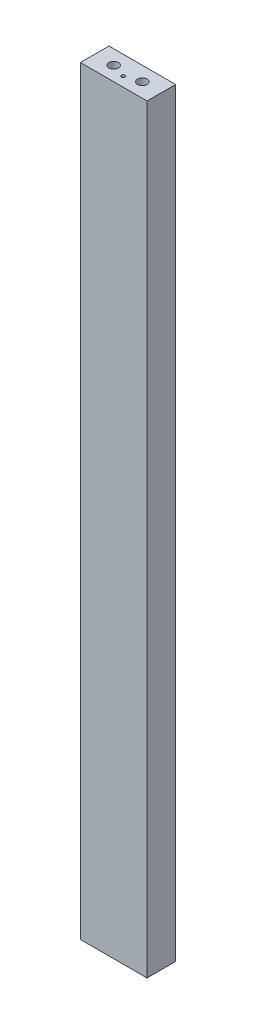
ISO-10303-21;
HEADER;
FILE_DESCRIPTION(('STEP AP214'),'2;1');
FILE_NAME('part.step','',(''),(''),'','','');
FILE_SCHEMA(('AUTOMOTIVE_DESIGN { 1 0 10303 214 1 1 1 1 }'));
ENDSEC;
DATA;
#1=APPLICATION_CONTEXT('core data for automotive mechanical design processes');
#2=APPLICATION_PROTOCOL_DEFINITION('international standard','automotive_design',2000,#1);
#3=PRODUCT_CONTEXT('',#1,'mechanical');
#4=PRODUCT('Part','Part','',(#3));
#5=PRODUCT_RELATED_PRODUCT_CATEGORY('part','',(#4));
#6=PRODUCT_DEFINITION_FORMATION('','',#4);
#7=PRODUCT_DEFINITION_CONTEXT('part definition',#1,'design');
#8=PRODUCT_DEFINITION('design','',#6,#7);
#9=PRODUCT_DEFINITION_SHAPE('','',#8);
#10=(LENGTH_UNIT() NAMED_UNIT(*) SI_UNIT(.MILLI.,.METRE.));
#11=(NAMED_UNIT(*) PLANE_ANGLE_UNIT() SI_UNIT($,.RADIAN.));
#12=(NAMED_UNIT(*) SI_UNIT($,.STERADIAN.) SOLID_ANGLE_UNIT());
#13=UNCERTAINTY_MEASURE_WITH_UNIT(LENGTH_MEASURE(1.E-05),#10,'distance_accuracy_value','');
#14=(GEOMETRIC_REPRESENTATION_CONTEXT(3) GLOBAL_UNCERTAINTY_ASSIGNED_CONTEXT((#13)) GLOBAL_UNIT_ASSIGNED_CONTEXT((#10,
#11,#12)) REPRESENTATION_CONTEXT('',''));
#15=CARTESIAN_POINT('',(0.,0.,0.));
#16=DIRECTION('',(0.,0.,1.));
#17=DIRECTION('',(1.,0.,0.));
#18=AXIS2_PLACEMENT_3D('',#15,#16,#17);
#19=CARTESIAN_POINT('',(0.,1012.825,0.));
#20=DIRECTION('',(1.,0.,0.));
#21=DIRECTION('',(0.,0.,-1.));
#22=AXIS2_PLACEMENT_3D('',#19,#20,#21);
#23=PLANE('',#22);
#24=DIRECTION('',(0.,0.,1.));
#25=VECTOR('',#24,1.);
#26=CARTESIAN_POINT('',(0.,0.,0.));
#27=LINE('',#26,#25);
#28=CARTESIAN_POINT('',(0.,0.,0.));
#29=VERTEX_POINT('',#28);
#30=CARTESIAN_POINT('',(0.,0.,38.1));
#31=VERTEX_POINT('',#30);
#32=EDGE_CURVE('E149',#29,#31,#27,.T.);
#33=ORIENTED_EDGE('',*,*,#32,.T.);
#34=DIRECTION('',(0.,-1.,0.));
#35=VECTOR('',#34,1.);
#36=CARTESIAN_POINT('',(0.,1012.825,38.1));
#37=LINE('',#36,#35);
#38=CARTESIAN_POINT('',(0.,1012.825,38.1));
#39=VERTEX_POINT('',#38);
#40=EDGE_CURVE('E12',#39,#31,#37,.T.);
#41=ORIENTED_EDGE('',*,*,#40,.F.);
#42=DIRECTION('',(0.,0.,1.));
#43=VECTOR('',#42,1.);
#44=CARTESIAN_POINT('',(0.,1012.825,0.));
#45=LINE('',#44,#43);
#46=CARTESIAN_POINT('',(0.,1012.825,0.));
#47=VERTEX_POINT('',#46);
#48=EDGE_CURVE('E158',#47,#39,#45,.T.);
#49=ORIENTED_EDGE('',*,*,#48,.F.);
#50=DIRECTION('',(0.,-1.,0.));
#51=VECTOR('',#50,1.);
#52=CARTESIAN_POINT('',(0.,1012.825,0.));
#53=LINE('',#52,#51);
#54=EDGE_CURVE('E164',#47,#29,#53,.T.);
#55=ORIENTED_EDGE('',*,*,#54,.T.);
#56=EDGE_LOOP('',(#33,#41,#49,#55));
#57=FACE_BOUND('',#56,.T.);
#58=ADVANCED_FACE('F49',(#57),#23,.F.);
#59=CARTESIAN_POINT('',(0.,1012.825,38.1));
#60=DIRECTION('',(0.,0.,-1.));
#61=DIRECTION('',(-1.,0.,0.));
#62=AXIS2_PLACEMENT_3D('',#59,#60,#61);
#63=PLANE('',#62);
#64=DIRECTION('',(1.,0.,0.));
#65=VECTOR('',#64,1.);
#66=CARTESIAN_POINT('',(0.,0.,38.1));
#67=LINE('',#66,#65);
#68=CARTESIAN_POINT('',(88.9,0.,38.1));
#69=VERTEX_POINT('',#68);
#70=EDGE_CURVE('E167',#31,#69,#67,.T.);
#71=ORIENTED_EDGE('',*,*,#70,.T.);
#72=DIRECTION('',(0.,-1.,0.));
#73=VECTOR('',#72,1.);
#74=CARTESIAN_POINT('',(88.9,1012.825,38.1));
#75=LINE('',#74,#73);
#76=CARTESIAN_POINT('',(88.9,1012.825,38.1));
#77=VERTEX_POINT('',#76);
#78=EDGE_CURVE('E57',#77,#69,#75,.T.);
#79=ORIENTED_EDGE('',*,*,#78,.F.);
#80=DIRECTION('',(1.,0.,0.));
#81=VECTOR('',#80,1.);
#82=CARTESIAN_POINT('',(0.,1012.825,38.1));
#83=LINE('',#82,#81);
#84=EDGE_CURVE('E96',#39,#77,#83,.T.);
#85=ORIENTED_EDGE('',*,*,#84,.F.);
#86=ORIENTED_EDGE('',*,*,#40,.T.);
#87=EDGE_LOOP('',(#71,#79,#85,#86));
#88=FACE_BOUND('',#87,.T.);
#89=ADVANCED_FACE('F192',(#88),#63,.F.);
#90=CARTESIAN_POINT('',(88.9,1012.825,0.));
#91=DIRECTION('',(-1.,0.,0.));
#92=DIRECTION('',(0.,0.,1.));
#93=AXIS2_PLACEMENT_3D('',#90,#91,#92);
#94=PLANE('',#93);
#95=DIRECTION('',(0.,0.,-1.));
#96=VECTOR('',#95,1.);
#97=CARTESIAN_POINT('',(88.9,0.,0.));
#98=LINE('',#97,#96);
#99=CARTESIAN_POINT('',(88.9,0.,0.));
#100=VERTEX_POINT('',#99);
#101=EDGE_CURVE('E83',#69,#100,#98,.T.);
#102=ORIENTED_EDGE('',*,*,#101,.T.);
#103=DIRECTION('',(0.,-1.,0.));
#104=VECTOR('',#103,1.);
#105=CARTESIAN_POINT('',(88.9,1012.825,0.));
#106=LINE('',#105,#104);
#107=CARTESIAN_POINT('',(88.9,1012.825,0.));
#108=VERTEX_POINT('',#107);
#109=EDGE_CURVE('E172',#108,#100,#106,.T.);
#110=ORIENTED_EDGE('',*,*,#109,.F.);
#111=DIRECTION('',(0.,0.,-1.));
#112=VECTOR('',#111,1.);
#113=CARTESIAN_POINT('',(88.9,1012.825,0.));
#114=LINE('',#113,#112);
#115=EDGE_CURVE('E161',#77,#108,#114,.T.);
#116=ORIENTED_EDGE('',*,*,#115,.F.);
#117=ORIENTED_EDGE('',*,*,#78,.T.);
#118=EDGE_LOOP('',(#102,#110,#116,#117));
#119=FACE_BOUND('',#118,.T.);
#120=ADVANCED_FACE('F174',(#119),#94,.F.);
#121=CARTESIAN_POINT('',(0.,1012.825,0.));
#122=DIRECTION('',(0.,0.,1.));
#123=DIRECTION('',(1.,0.,0.));
#124=AXIS2_PLACEMENT_3D('',#121,#122,#123);
#125=PLANE('',#124);
#126=DIRECTION('',(-1.,0.,0.));
#127=VECTOR('',#126,1.);
#128=CARTESIAN_POINT('',(0.,0.,0.));
#129=LINE('',#128,#127);
#130=EDGE_CURVE('E89',#100,#29,#129,.T.);
#131=ORIENTED_EDGE('',*,*,#130,.T.);
#132=ORIENTED_EDGE('',*,*,#54,.F.);
#133=DIRECTION('',(-1.,0.,0.));
#134=VECTOR('',#133,1.);
#135=CARTESIAN_POINT('',(0.,1012.825,0.));
#136=LINE('',#135,#134);
#137=EDGE_CURVE('E65',#108,#47,#136,.T.);
#138=ORIENTED_EDGE('',*,*,#137,.F.);
#139=ORIENTED_EDGE('',*,*,#109,.T.);
#140=EDGE_LOOP('',(#131,#132,#138,#139));
#141=FACE_BOUND('',#140,.T.);
#142=ADVANCED_FACE('F181',(#141),#125,.F.);
#143=CARTESIAN_POINT('',(0.,1012.825,0.));
#144=DIRECTION('',(0.,1.,0.));
#145=DIRECTION('',(0.,0.,1.));
#146=AXIS2_PLACEMENT_3D('',#143,#144,#145);
#147=PLANE('',#146);
#148=CARTESIAN_POINT('',(44.45,1012.825,25.4));
#149=DIRECTION('',(0.,1.,0.));
#150=DIRECTION('',(0.,0.,1.));
#151=AXIS2_PLACEMENT_3D('',#148,#149,#150);
#152=CIRCLE('',#151,2.45744999999999);
#153=CARTESIAN_POINT('',(44.45,1012.825,27.85745));
#154=VERTEX_POINT('',#153);
#155=EDGE_CURVE('E117',#154,#154,#152,.T.);
#156=ORIENTED_EDGE('',*,*,#155,.F.);
#157=EDGE_LOOP('',(#156));
#158=FACE_BOUND('',#157,.T.);
#159=CARTESIAN_POINT('',(25.4,1012.825,19.05));
#160=DIRECTION('',(0.,1.,0.));
#161=DIRECTION('',(0.,0.,1.));
#162=AXIS2_PLACEMENT_3D('',#159,#160,#161);
#163=CIRCLE('',#162,6.35000000000001);
#164=CARTESIAN_POINT('',(25.4,1012.825,25.4));
#165=VERTEX_POINT('',#164);
#166=EDGE_CURVE('E150',#165,#165,#163,.T.);
#167=ORIENTED_EDGE('',*,*,#166,.F.);
#168=EDGE_LOOP('',(#167));
#169=FACE_BOUND('',#168,.T.);
#170=CARTESIAN_POINT('',(63.5,1012.825,19.05));
#171=DIRECTION('',(0.,1.,0.));
#172=DIRECTION('',(0.,0.,1.));
#173=AXIS2_PLACEMENT_3D('',#170,#171,#172);
#174=CIRCLE('',#173,6.35);
#175=CARTESIAN_POINT('',(63.5,1012.825,25.4));
#176=VERTEX_POINT('',#175);
#177=EDGE_CURVE('E153',#176,#176,#174,.T.);
#178=ORIENTED_EDGE('',*,*,#177,.F.);
#179=EDGE_LOOP('',(#178));
#180=FACE_BOUND('',#179,.T.);
#181=ORIENTED_EDGE('',*,*,#48,.T.);
#182=ORIENTED_EDGE('',*,*,#84,.T.);
#183=ORIENTED_EDGE('',*,*,#115,.T.);
#184=ORIENTED_EDGE('',*,*,#137,.T.);
#185=EDGE_LOOP('',(#181,#182,#183,#184));
#186=FACE_BOUND('',#185,.T.);
#187=ADVANCED_FACE('F183',(#158,#169,#180,#186),#147,.T.);
#188=CARTESIAN_POINT('',(0.,0.,0.));
#189=DIRECTION('',(0.,1.,0.));
#190=DIRECTION('',(0.,0.,1.));
#191=AXIS2_PLACEMENT_3D('',#188,#189,#190);
#192=PLANE('',#191);
#193=CARTESIAN_POINT('',(12.7,0.,19.05));
#194=DIRECTION('',(0.,-1.,0.));
#195=DIRECTION('',(0.,0.,-1.));
#196=AXIS2_PLACEMENT_3D('',#193,#194,#195);
#197=CIRCLE('',#196,2.45744999999999);
#198=CARTESIAN_POINT('',(12.7,0.,16.59255));
#199=VERTEX_POINT('',#198);
#200=EDGE_CURVE('E116',#199,#199,#197,.T.);
#201=ORIENTED_EDGE('',*,*,#200,.F.);
#202=EDGE_LOOP('',(#201));
#203=FACE_BOUND('',#202,.T.);
#204=CARTESIAN_POINT('',(76.2,0.,25.4));
#205=DIRECTION('',(0.,-1.,0.));
#206=DIRECTION('',(0.,0.,-1.));
#207=AXIS2_PLACEMENT_3D('',#204,#205,#206);
#208=CIRCLE('',#207,2.45744999999999);
#209=CARTESIAN_POINT('',(76.2,0.,22.94255));
#210=VERTEX_POINT('',#209);
#211=EDGE_CURVE('E127',#210,#210,#208,.T.);
#212=ORIENTED_EDGE('',*,*,#211,.F.);
#213=EDGE_LOOP('',(#212));
#214=FACE_BOUND('',#213,.T.);
#215=CARTESIAN_POINT('',(25.4,0.,19.05));
#216=DIRECTION('',(0.,-1.,0.));
#217=DIRECTION('',(0.,0.,-1.));
#218=AXIS2_PLACEMENT_3D('',#215,#216,#217);
#219=CIRCLE('',#218,6.35000000000001);
#220=CARTESIAN_POINT('',(25.4,0.,12.7));
#221=VERTEX_POINT('',#220);
#222=EDGE_CURVE('E138',#221,#221,#219,.T.);
#223=ORIENTED_EDGE('',*,*,#222,.F.);
#224=EDGE_LOOP('',(#223));
#225=FACE_BOUND('',#224,.T.);
#226=CARTESIAN_POINT('',(63.5,0.,19.05));
#227=DIRECTION('',(0.,-1.,0.));
#228=DIRECTION('',(0.,0.,-1.));
#229=AXIS2_PLACEMENT_3D('',#226,#227,#228);
#230=CIRCLE('',#229,6.35);
#231=CARTESIAN_POINT('',(63.5,0.,12.7));
#232=VERTEX_POINT('',#231);
#233=EDGE_CURVE('E141',#232,#232,#230,.T.);
#234=ORIENTED_EDGE('',*,*,#233,.F.);
#235=EDGE_LOOP('',(#234));
#236=FACE_BOUND('',#235,.T.);
#237=ORIENTED_EDGE('',*,*,#32,.F.);
#238=ORIENTED_EDGE('',*,*,#130,.F.);
#239=ORIENTED_EDGE('',*,*,#101,.F.);
#240=ORIENTED_EDGE('',*,*,#70,.F.);
#241=EDGE_LOOP('',(#237,#238,#239,#240));
#242=FACE_BOUND('',#241,.T.);
#243=ADVANCED_FACE('F177',(#203,#214,#225,#236,#242),#192,.F.);
#244=CARTESIAN_POINT('',(63.5,993.775,19.05));
#245=DIRECTION('',(0.,1.,0.));
#246=DIRECTION('',(0.,0.,1.));
#247=AXIS2_PLACEMENT_3D('',#244,#245,#246);
#248=CYLINDRICAL_SURFACE('',#247,6.35);
#249=CARTESIAN_POINT('',(63.5,993.775,19.05));
#250=DIRECTION('',(0.,1.,0.));
#251=DIRECTION('',(0.,0.,1.));
#252=AXIS2_PLACEMENT_3D('',#249,#250,#251);
#253=CIRCLE('',#252,6.35);
#254=CARTESIAN_POINT('',(63.5,993.775,25.4));
#255=VERTEX_POINT('',#254);
#256=EDGE_CURVE('E137',#255,#255,#253,.T.);
#257=ORIENTED_EDGE('',*,*,#256,.F.);
#258=EDGE_LOOP('',(#257));
#259=FACE_BOUND('',#258,.T.);
#260=ORIENTED_EDGE('',*,*,#177,.T.);
#261=EDGE_LOOP('',(#260));
#262=FACE_BOUND('',#261,.T.);
#263=ADVANCED_FACE('F227',(#259,#262),#248,.F.);
#264=CARTESIAN_POINT('',(63.5,993.775,19.05));
#265=DIRECTION('',(0.,1.,0.));
#266=DIRECTION('',(0.,0.,1.));
#267=AXIS2_PLACEMENT_3D('',#264,#265,#266);
#268=PLANE('',#267);
#269=ORIENTED_EDGE('',*,*,#256,.T.);
#270=EDGE_LOOP('',(#269));
#271=FACE_BOUND('',#270,.T.);
#272=ADVANCED_FACE('F236',(#271),#268,.T.);
#273=CARTESIAN_POINT('',(25.4,993.775,19.05));
#274=DIRECTION('',(0.,1.,0.));
#275=DIRECTION('',(0.,0.,1.));
#276=AXIS2_PLACEMENT_3D('',#273,#274,#275);
#277=CYLINDRICAL_SURFACE('',#276,6.35000000000001);
#278=CARTESIAN_POINT('',(25.4,993.775,19.05));
#279=DIRECTION('',(0.,1.,0.));
#280=DIRECTION('',(0.,0.,1.));
#281=AXIS2_PLACEMENT_3D('',#278,#279,#280);
#282=CIRCLE('',#281,6.35000000000001);
#283=CARTESIAN_POINT('',(25.4,993.775,25.4));
#284=VERTEX_POINT('',#283);
#285=EDGE_CURVE('E146',#284,#284,#282,.T.);
#286=ORIENTED_EDGE('',*,*,#285,.F.);
#287=EDGE_LOOP('',(#286));
#288=FACE_BOUND('',#287,.T.);
#289=ORIENTED_EDGE('',*,*,#166,.T.);
#290=EDGE_LOOP('',(#289));
#291=FACE_BOUND('',#290,.T.);
#292=ADVANCED_FACE('F246',(#288,#291),#277,.F.);
#293=CARTESIAN_POINT('',(25.4,993.775,19.05));
#294=DIRECTION('',(0.,1.,0.));
#295=DIRECTION('',(0.,0.,1.));
#296=AXIS2_PLACEMENT_3D('',#293,#294,#295);
#297=PLANE('',#296);
#298=ORIENTED_EDGE('',*,*,#285,.T.);
#299=EDGE_LOOP('',(#298));
#300=FACE_BOUND('',#299,.T.);
#301=ADVANCED_FACE('F256',(#300),#297,.T.);
#302=CARTESIAN_POINT('',(63.5,19.05,19.05));
#303=DIRECTION('',(0.,-1.,0.));
#304=DIRECTION('',(0.,0.,-1.));
#305=AXIS2_PLACEMENT_3D('',#302,#303,#304);
#306=CYLINDRICAL_SURFACE('',#305,6.35);
#307=CARTESIAN_POINT('',(63.5,19.05,19.05));
#308=DIRECTION('',(0.,-1.,0.));
#309=DIRECTION('',(0.,0.,-1.));
#310=AXIS2_PLACEMENT_3D('',#307,#308,#309);
#311=CIRCLE('',#310,6.35);
#312=CARTESIAN_POINT('',(63.5,19.05,12.7));
#313=VERTEX_POINT('',#312);
#314=EDGE_CURVE('E133',#313,#313,#311,.T.);
#315=ORIENTED_EDGE('',*,*,#314,.F.);
#316=EDGE_LOOP('',(#315));
#317=FACE_BOUND('',#316,.T.);
#318=ORIENTED_EDGE('',*,*,#233,.T.);
#319=EDGE_LOOP('',(#318));
#320=FACE_BOUND('',#319,.T.);
#321=ADVANCED_FACE('F266',(#317,#320),#306,.F.);
#322=CARTESIAN_POINT('',(63.5,19.05,19.05));
#323=DIRECTION('',(0.,-1.,0.));
#324=DIRECTION('',(0.,0.,-1.));
#325=AXIS2_PLACEMENT_3D('',#322,#323,#324);
#326=PLANE('',#325);
#327=ORIENTED_EDGE('',*,*,#314,.T.);
#328=EDGE_LOOP('',(#327));
#329=FACE_BOUND('',#328,.T.);
#330=ADVANCED_FACE('F276',(#329),#326,.T.);
#331=CARTESIAN_POINT('',(25.4,19.05,19.05));
#332=DIRECTION('',(0.,-1.,0.));
#333=DIRECTION('',(0.,0.,-1.));
#334=AXIS2_PLACEMENT_3D('',#331,#332,#333);
#335=CYLINDRICAL_SURFACE('',#334,6.35000000000001);
#336=CARTESIAN_POINT('',(25.4,19.05,19.05));
#337=DIRECTION('',(0.,-1.,0.));
#338=DIRECTION('',(0.,0.,-1.));
#339=AXIS2_PLACEMENT_3D('',#336,#337,#338);
#340=CIRCLE('',#339,6.35000000000001);
#341=CARTESIAN_POINT('',(25.4,19.05,12.7));
#342=VERTEX_POINT('',#341);
#343=EDGE_CURVE('E134',#342,#342,#340,.T.);
#344=ORIENTED_EDGE('',*,*,#343,.F.);
#345=EDGE_LOOP('',(#344));
#346=FACE_BOUND('',#345,.T.);
#347=ORIENTED_EDGE('',*,*,#222,.T.);
#348=EDGE_LOOP('',(#347));
#349=FACE_BOUND('',#348,.T.);
#350=ADVANCED_FACE('F286',(#346,#349),#335,.F.);
#351=CARTESIAN_POINT('',(25.4,19.05,19.05));
#352=DIRECTION('',(0.,-1.,0.));
#353=DIRECTION('',(0.,0.,-1.));
#354=AXIS2_PLACEMENT_3D('',#351,#352,#353);
#355=PLANE('',#354);
#356=ORIENTED_EDGE('',*,*,#343,.T.);
#357=EDGE_LOOP('',(#356));
#358=FACE_BOUND('',#357,.T.);
#359=ADVANCED_FACE('F296',(#358),#355,.T.);
#360=CARTESIAN_POINT('',(76.2,76.2,25.4));
#361=DIRECTION('',(0.,-1.,0.));
#362=DIRECTION('',(0.,0.,-1.));
#363=AXIS2_PLACEMENT_3D('',#360,#361,#362);
#364=CONICAL_SURFACE('',#363,2.45744999999999,1.02974425867665);
#365=CARTESIAN_POINT('',(76.2,77.6765849282293,25.4));
#366=VERTEX_POINT('',#365);
#367=VERTEX_LOOP('',#366);
#368=FACE_BOUND('',#367,.T.);
#369=CARTESIAN_POINT('',(76.2,76.2,25.4));
#370=DIRECTION('',(0.,-1.,0.));
#371=DIRECTION('',(0.,0.,-1.));
#372=AXIS2_PLACEMENT_3D('',#369,#370,#371);
#373=CIRCLE('',#372,2.45744999999999);
#374=CARTESIAN_POINT('',(76.2,76.2,22.94255));
#375=VERTEX_POINT('',#374);
#376=EDGE_CURVE('E130',#375,#375,#373,.T.);
#377=ORIENTED_EDGE('',*,*,#376,.T.);
#378=EDGE_LOOP('',(#377));
#379=FACE_BOUND('',#378,.T.);
#380=ADVANCED_FACE('F305',(#368,#379),#364,.F.);
#381=CARTESIAN_POINT('',(76.2,0.,25.4));
#382=DIRECTION('',(0.,-1.,0.));
#383=DIRECTION('',(0.,0.,-1.));
#384=AXIS2_PLACEMENT_3D('',#381,#382,#383);
#385=CYLINDRICAL_SURFACE('',#384,2.45744999999999);
#386=ORIENTED_EDGE('',*,*,#376,.F.);
#387=EDGE_LOOP('',(#386));
#388=FACE_BOUND('',#387,.T.);
#389=ORIENTED_EDGE('',*,*,#211,.T.);
#390=EDGE_LOOP('',(#389));
#391=FACE_BOUND('',#390,.T.);
#392=ADVANCED_FACE('F314',(#388,#391),#385,.F.);
#393=CARTESIAN_POINT('',(12.7,76.2,19.05));
#394=DIRECTION('',(0.,-1.,0.));
#395=DIRECTION('',(0.,0.,-1.));
#396=AXIS2_PLACEMENT_3D('',#393,#394,#395);
#397=CONICAL_SURFACE('',#396,2.45744999999999,1.02974425867665);
#398=CARTESIAN_POINT('',(12.7,77.6765849282293,19.05));
#399=VERTEX_POINT('',#398);
#400=VERTEX_LOOP('',#399);
#401=FACE_BOUND('',#400,.T.);
#402=CARTESIAN_POINT('',(12.7,76.2,19.05));
#403=DIRECTION('',(0.,-1.,0.));
#404=DIRECTION('',(0.,0.,-1.));
#405=AXIS2_PLACEMENT_3D('',#402,#403,#404);
#406=CIRCLE('',#405,2.45744999999999);
#407=CARTESIAN_POINT('',(12.7,76.2,16.59255));
#408=VERTEX_POINT('',#407);
#409=EDGE_CURVE('E120',#408,#408,#406,.T.);
#410=ORIENTED_EDGE('',*,*,#409,.T.);
#411=EDGE_LOOP('',(#410));
#412=FACE_BOUND('',#411,.T.);
#413=ADVANCED_FACE('F324',(#401,#412),#397,.F.);
#414=CARTESIAN_POINT('',(12.7,0.,19.05));
#415=DIRECTION('',(0.,-1.,0.));
#416=DIRECTION('',(0.,0.,-1.));
#417=AXIS2_PLACEMENT_3D('',#414,#415,#416);
#418=CYLINDRICAL_SURFACE('',#417,2.45744999999999);
#419=ORIENTED_EDGE('',*,*,#409,.F.);
#420=EDGE_LOOP('',(#419));
#421=FACE_BOUND('',#420,.T.);
#422=ORIENTED_EDGE('',*,*,#200,.T.);
#423=EDGE_LOOP('',(#422));
#424=FACE_BOUND('',#423,.T.);
#425=ADVANCED_FACE('F110',(#421,#424),#418,.F.);
#426=CARTESIAN_POINT('',(44.45,936.625,25.4));
#427=DIRECTION('',(0.,1.,0.));
#428=DIRECTION('',(0.,0.,1.));
#429=AXIS2_PLACEMENT_3D('',#426,#427,#428);
#430=CONICAL_SURFACE('',#429,2.45744999999999,1.02974425867667);
#431=CARTESIAN_POINT('',(44.45,935.148415071771,25.4));
#432=VERTEX_POINT('',#431);
#433=VERTEX_LOOP('',#432);
#434=FACE_BOUND('',#433,.T.);
#435=CARTESIAN_POINT('',(44.45,936.625,25.4));
#436=DIRECTION('',(0.,1.,0.));
#437=DIRECTION('',(0.,0.,1.));
#438=AXIS2_PLACEMENT_3D('',#435,#436,#437);
#439=CIRCLE('',#438,2.45744999999999);
#440=CARTESIAN_POINT('',(44.45,936.625,27.85745));
#441=VERTEX_POINT('',#440);
#442=EDGE_CURVE('E114',#441,#441,#439,.T.);
#443=ORIENTED_EDGE('',*,*,#442,.T.);
#444=EDGE_LOOP('',(#443));
#445=FACE_BOUND('',#444,.T.);
#446=ADVANCED_FACE('F106',(#434,#445),#430,.F.);
#447=CARTESIAN_POINT('',(44.45,1012.825,25.4));
#448=DIRECTION('',(0.,1.,0.));
#449=DIRECTION('',(0.,0.,1.));
#450=AXIS2_PLACEMENT_3D('',#447,#448,#449);
#451=CYLINDRICAL_SURFACE('',#450,2.45744999999999);
#452=ORIENTED_EDGE('',*,*,#442,.F.);
#453=EDGE_LOOP('',(#452));
#454=FACE_BOUND('',#453,.T.);
#455=ORIENTED_EDGE('',*,*,#155,.T.);
#456=EDGE_LOOP('',(#455));
#457=FACE_BOUND('',#456,.T.);
#458=ADVANCED_FACE('F109',(#454,#457),#451,.F.);
#459=CLOSED_SHELL('',(#58,#89,#120,#142,#187,#243,#263,#272,#292,#301,#321,#330,#350,#359,#380,
#392,#413,#425,#446,#458));
#460=MANIFOLD_SOLID_BREP('B2',#459);
#461=ADVANCED_BREP_SHAPE_REPRESENTATION('',(#18,#460),#14);
#462=SHAPE_DEFINITION_REPRESENTATION(#9,#461);
ENDSEC;
END-ISO-10303-21;
